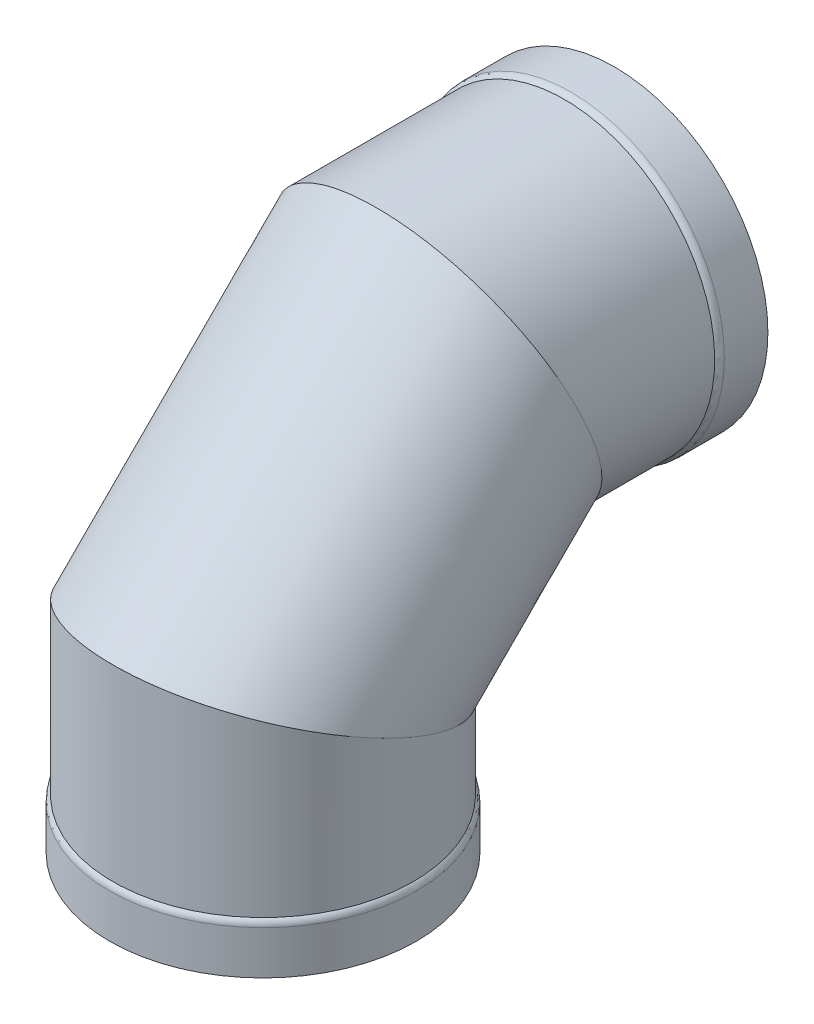
ISO-10303-21;
HEADER;
FILE_DESCRIPTION(('STEP AP214'),'2;1');
FILE_NAME('part.step','',(''),(''),'','','');
FILE_SCHEMA(('AUTOMOTIVE_DESIGN { 1 0 10303 214 1 1 1 1 }'));
ENDSEC;
DATA;
#1=APPLICATION_CONTEXT('core data for automotive mechanical design processes');
#2=APPLICATION_PROTOCOL_DEFINITION('international standard','automotive_design',2000,#1);
#3=PRODUCT_CONTEXT('',#1,'mechanical');
#4=PRODUCT('Part','Part','',(#3));
#5=PRODUCT_RELATED_PRODUCT_CATEGORY('part','',(#4));
#6=PRODUCT_DEFINITION_FORMATION('','',#4);
#7=PRODUCT_DEFINITION_CONTEXT('part definition',#1,'design');
#8=PRODUCT_DEFINITION('design','',#6,#7);
#9=PRODUCT_DEFINITION_SHAPE('','',#8);
#10=(LENGTH_UNIT() NAMED_UNIT(*) SI_UNIT(.MILLI.,.METRE.));
#11=(NAMED_UNIT(*) PLANE_ANGLE_UNIT() SI_UNIT($,.RADIAN.));
#12=(NAMED_UNIT(*) SI_UNIT($,.STERADIAN.) SOLID_ANGLE_UNIT());
#13=UNCERTAINTY_MEASURE_WITH_UNIT(LENGTH_MEASURE(1.E-05),#10,'distance_accuracy_value','');
#14=(GEOMETRIC_REPRESENTATION_CONTEXT(3) GLOBAL_UNCERTAINTY_ASSIGNED_CONTEXT((#13)) GLOBAL_UNIT_ASSIGNED_CONTEXT((#10,
#11,#12)) REPRESENTATION_CONTEXT('',''));
#15=CARTESIAN_POINT('',(0.,0.,0.));
#16=DIRECTION('',(0.,0.,1.));
#17=DIRECTION('',(1.,0.,0.));
#18=AXIS2_PLACEMENT_3D('',#15,#16,#17);
#19=CARTESIAN_POINT('',(0.,534.752662721893,-268.052662721892));
#20=DIRECTION('',(0.,-0.384615384615389,0.923076923076921));
#21=DIRECTION('',(0.,-0.923076923076922,-0.384615384615389));
#22=AXIS2_PLACEMENT_3D('',#19,#20,#21);
#23=PLANE('',#22);
#24=CARTESIAN_POINT('',(0.,534.752662721893,-268.052662721892));
#25=DIRECTION('',(0.,-0.384615384615389,0.923076923076921));
#26=DIRECTION('',(0.,-0.923076923076922,-0.384615384615389));
#27=AXIS2_PLACEMENT_3D('',#24,#25,#26);
#28=ELLIPSE('',#27,242.490625,223.8375);
#29=CARTESIAN_POINT('',(0.,310.915162721894,-361.318287721893));
#30=VERTEX_POINT('',#29);
#31=EDGE_CURVE('E91',#30,#30,#28,.T.);
#32=ORIENTED_EDGE('',*,*,#31,.T.);
#33=EDGE_LOOP('',(#32));
#34=FACE_BOUND('',#33,.T.);
#35=CARTESIAN_POINT('',(0.,534.752662721893,-268.052662721892));
#36=DIRECTION('',(0.,-0.384615384615389,0.923076923076921));
#37=DIRECTION('',(0.,-0.923076923076922,-0.384615384615389));
#38=AXIS2_PLACEMENT_3D('',#35,#36,#37);
#39=ELLIPSE('',#38,247.65,228.6);
#40=CARTESIAN_POINT('',(0.,306.152662721894,-363.302662721893));
#41=VERTEX_POINT('',#40);
#42=EDGE_CURVE('E12',#41,#41,#39,.T.);
#43=ORIENTED_EDGE('',*,*,#42,.F.);
#44=EDGE_LOOP('',(#43));
#45=FACE_BOUND('',#44,.T.);
#46=ADVANCED_FACE('F74',(#34,#45),#23,.F.);
#47=CARTESIAN_POINT('',(0.,266.7,0.));
#48=DIRECTION('',(0.,0.923076923076923,-0.384615384615385));
#49=DIRECTION('',(0.,0.384615384615385,0.923076923076923));
#50=AXIS2_PLACEMENT_3D('',#47,#48,#49);
#51=PLANE('',#50);
#52=CARTESIAN_POINT('',(0.,266.7,0.));
#53=DIRECTION('',(0.,0.923076923076923,-0.384615384615385));
#54=DIRECTION('',(0.,-0.384615384615385,-0.923076923076923));
#55=AXIS2_PLACEMENT_3D('',#52,#53,#54);
#56=ELLIPSE('',#55,242.490625,223.8375);
#57=CARTESIAN_POINT('',(0.,173.434375,-223.8375));
#58=VERTEX_POINT('',#57);
#59=EDGE_CURVE('E105',#58,#58,#56,.T.);
#60=ORIENTED_EDGE('',*,*,#59,.T.);
#61=EDGE_LOOP('',(#60));
#62=FACE_BOUND('',#61,.T.);
#63=CARTESIAN_POINT('',(0.,266.7,0.));
#64=DIRECTION('',(0.,0.923076923076923,-0.384615384615385));
#65=DIRECTION('',(0.,-0.384615384615385,-0.923076923076923));
#66=AXIS2_PLACEMENT_3D('',#63,#64,#65);
#67=ELLIPSE('',#66,247.65,228.6);
#68=CARTESIAN_POINT('',(0.,171.45,-228.6));
#69=VERTEX_POINT('',#68);
#70=EDGE_CURVE('E83',#69,#69,#67,.T.);
#71=ORIENTED_EDGE('',*,*,#70,.F.);
#72=EDGE_LOOP('',(#71));
#73=FACE_BOUND('',#72,.T.);
#74=ADVANCED_FACE('F113',(#62,#73),#51,.F.);
#75=CARTESIAN_POINT('',(0.0286465473319404,361.949999252128,228.599998205108));
#76=CARTESIAN_POINT('',(0.0920664822576588,763.352644182441,-172.802670446663));
#77=CARTESIAN_POINT('',(457.228642957548,361.926127129352,228.542705110444));
#78=CARTESIAN_POINT('',(457.292029403353,763.168511217926,-172.879392515211));
#79=CARTESIAN_POINT('',(457.171349862884,171.426128625095,-228.657291299772));
#80=CARTESIAN_POINT('',(457.107896438838,305.968548296831,-363.37937706567));
#81=CARTESIAN_POINT('',(-0.0286465473320699,171.450000747872,-228.599998205108));
#82=CARTESIAN_POINT('',(-0.0920664822576868,306.152681261346,-363.302654997121));
#83=CARTESIAN_POINT('',(-457.228642957548,171.473872870648,-228.542705110444));
#84=CARTESIAN_POINT('',(-457.292029403353,306.336814225861,-363.225932928573));
#85=CARTESIAN_POINT('',(-457.171349862884,361.973871374905,228.657291299772));
#86=CARTESIAN_POINT('',(-457.107896438838,763.536777146956,-172.725948378115));
#87=CARTESIAN_POINT('',(0.0286465473319404,361.949999252128,228.599998205108));
#88=CARTESIAN_POINT('',(0.0920664822576588,763.352644182441,-172.802670446663));
#89=(BOUNDED_SURFACE() B_SPLINE_SURFACE(3,1,((#75,#76),(#77,#78),(#79,#80),(#81,#82),(#83,#84),
(#85,#86),(#87,#88)),.UNSPECIFIED.,.T.,.F.,.F.) B_SPLINE_SURFACE_WITH_KNOTS((4,3,4),(2,2),(0.,
0.5,1.),(0.,1.),.UNSPECIFIED.) GEOMETRIC_REPRESENTATION_ITEM() RATIONAL_B_SPLINE_SURFACE(((1.,
1.),(0.333333333333333,0.333333333333333),(0.333333333333333,0.333333333333333),(1.,1.),
(0.333333333333333,0.333333333333333),(0.333333333333333,0.333333333333333),(1.,1.))) REPRESENTATION_ITEM('') SURFACE());
#90=ORIENTED_EDGE('',*,*,#70,.T.);
#91=EDGE_LOOP('',(#90));
#92=FACE_BOUND('',#91,.T.);
#93=ORIENTED_EDGE('',*,*,#42,.T.);
#94=EDGE_LOOP('',(#93));
#95=FACE_BOUND('',#94,.T.);
#96=ADVANCED_FACE('F133',(#92,#95),#89,.T.);
#97=CARTESIAN_POINT('',(0.,173.434375,-223.8375));
#98=CARTESIAN_POINT('',(0.,310.915162721894,-361.318287721893));
#99=CARTESIAN_POINT('',(-447.675,173.434375,-223.8375));
#100=CARTESIAN_POINT('',(-447.675,310.915162721894,-361.318287721893));
#101=CARTESIAN_POINT('',(-447.675,359.965625,223.8375));
#102=CARTESIAN_POINT('',(-447.675,758.590162721893,-174.787037721891));
#103=CARTESIAN_POINT('',(0.,359.965625,223.8375));
#104=CARTESIAN_POINT('',(0.,758.590162721893,-174.787037721891));
#105=CARTESIAN_POINT('',(447.675,359.965625,223.8375));
#106=CARTESIAN_POINT('',(447.675,758.590162721893,-174.787037721891));
#107=CARTESIAN_POINT('',(447.675,173.434375,-223.8375));
#108=CARTESIAN_POINT('',(447.675,310.915162721894,-361.318287721893));
#109=CARTESIAN_POINT('',(0.,173.434375,-223.8375));
#110=CARTESIAN_POINT('',(0.,310.915162721894,-361.318287721893));
#111=(BOUNDED_SURFACE() B_SPLINE_SURFACE(3,1,((#97,#98),(#99,#100),(#101,#102),(#103,#104),
(#105,#106),(#107,#108),(#109,#110)),.UNSPECIFIED.,.T.,.F.,.F.) B_SPLINE_SURFACE_WITH_KNOTS((4,
3,4),(2,2),(0.,0.5,1.),(0.,1.),
.UNSPECIFIED.) GEOMETRIC_REPRESENTATION_ITEM() RATIONAL_B_SPLINE_SURFACE(((1.,1.),
(0.333333333333333,0.333333333333333),(0.333333333333333,0.333333333333333),(1.,1.),
(0.333333333333333,0.333333333333333),(0.333333333333333,0.333333333333333),(1.,1.))) REPRESENTATION_ITEM('') SURFACE());
#112=ORIENTED_EDGE('',*,*,#59,.F.);
#113=EDGE_LOOP('',(#112));
#114=FACE_BOUND('',#113,.T.);
#115=ORIENTED_EDGE('',*,*,#31,.F.);
#116=EDGE_LOOP('',(#115));
#117=FACE_BOUND('',#116,.T.);
#118=ADVANCED_FACE('F134',(#114,#117),#111,.F.);
#119=CLOSED_SHELL('',(#46,#74,#96,#118));
#120=MANIFOLD_SOLID_BREP('B2',#119);
#121=CARTESIAN_POINT('',(0.,534.752662721895,-586.86645582534));
#122=DIRECTION('',(0.,0.,-1.));
#123=DIRECTION('',(0.,-1.,0.));
#124=AXIS2_PLACEMENT_3D('',#121,#122,#123);
#125=CYLINDRICAL_SURFACE('',#124,228.6);
#126=CARTESIAN_POINT('',(0.,534.752662721894,-458.552662721892));
#127=DIRECTION('',(0.,0.,1.));
#128=DIRECTION('',(0.,-1.,0.));
#129=AXIS2_PLACEMENT_3D('',#126,#127,#128);
#130=CIRCLE('',#129,228.6);
#131=CARTESIAN_POINT('',(0.,306.152662721894,-458.552662721893));
#132=VERTEX_POINT('',#131);
#133=EDGE_CURVE('E275',#132,#132,#130,.T.);
#134=ORIENTED_EDGE('',*,*,#133,.T.);
#135=EDGE_LOOP('',(#134));
#136=FACE_BOUND('',#135,.T.);
#137=CARTESIAN_POINT('',(0.,534.752662721893,-268.052662721892));
#138=DIRECTION('',(0.,-0.384615384615389,0.923076923076921));
#139=DIRECTION('',(0.,-0.923076923076921,-0.384615384615389));
#140=AXIS2_PLACEMENT_3D('',#137,#138,#139);
#141=ELLIPSE('',#140,247.65,228.6);
#142=CARTESIAN_POINT('',(0.,306.152662721894,-363.302662721893));
#143=VERTEX_POINT('',#142);
#144=EDGE_CURVE('E287',#143,#143,#141,.T.);
#145=ORIENTED_EDGE('',*,*,#144,.F.);
#146=EDGE_LOOP('',(#145));
#147=FACE_BOUND('',#146,.T.);
#148=ADVANCED_FACE('F261',(#136,#147),#125,.T.);
#149=CARTESIAN_POINT('',(0.,534.752662721895,-586.86645582534));
#150=DIRECTION('',(0.,0.,-1.));
#151=DIRECTION('',(0.,-1.,0.));
#152=AXIS2_PLACEMENT_3D('',#149,#150,#151);
#153=CYLINDRICAL_SURFACE('',#152,233.3625);
#154=CARTESIAN_POINT('',(0.,534.752662721894,-468.46659704435));
#155=DIRECTION('',(0.,0.,1.));
#156=DIRECTION('',(0.,-1.,0.));
#157=AXIS2_PLACEMENT_3D('',#154,#155,#156);
#158=CIRCLE('',#157,233.3625);
#159=CARTESIAN_POINT('',(0.,301.390162721894,-468.466597044351));
#160=VERTEX_POINT('',#159);
#161=EDGE_CURVE('E269',#160,#160,#158,.F.);
#162=ORIENTED_EDGE('',*,*,#161,.T.);
#163=EDGE_LOOP('',(#162));
#164=FACE_BOUND('',#163,.T.);
#165=CARTESIAN_POINT('',(0.,534.752662721894,-534.752662721892));
#166=DIRECTION('',(0.,0.,1.));
#167=DIRECTION('',(0.,-1.,0.));
#168=AXIS2_PLACEMENT_3D('',#165,#166,#167);
#169=CIRCLE('',#168,233.3625);
#170=CARTESIAN_POINT('',(0.,301.390162721894,-534.752662721893));
#171=VERTEX_POINT('',#170);
#172=EDGE_CURVE('E281',#171,#171,#169,.T.);
#173=ORIENTED_EDGE('',*,*,#172,.T.);
#174=EDGE_LOOP('',(#173));
#175=FACE_BOUND('',#174,.T.);
#176=ADVANCED_FACE('F308',(#164,#175),#153,.T.);
#177=CARTESIAN_POINT('',(0.,768.115162721895,-534.752662721891));
#178=DIRECTION('',(0.,0.,1.));
#179=DIRECTION('',(0.,1.,0.));
#180=AXIS2_PLACEMENT_3D('',#177,#178,#179);
#181=PLANE('',#180);
#182=CARTESIAN_POINT('',(0.,534.752662721894,-534.752662721892));
#183=DIRECTION('',(0.,0.,1.));
#184=DIRECTION('',(0.,-1.,0.));
#185=AXIS2_PLACEMENT_3D('',#182,#183,#184);
#186=CIRCLE('',#185,228.6);
#187=CARTESIAN_POINT('',(0.,306.152662721894,-534.752662721893));
#188=VERTEX_POINT('',#187);
#189=EDGE_CURVE('E292',#188,#188,#186,.T.);
#190=ORIENTED_EDGE('',*,*,#189,.T.);
#191=EDGE_LOOP('',(#190));
#192=FACE_BOUND('',#191,.T.);
#193=ORIENTED_EDGE('',*,*,#172,.F.);
#194=EDGE_LOOP('',(#193));
#195=FACE_BOUND('',#194,.T.);
#196=ADVANCED_FACE('F314',(#192,#195),#181,.F.);
#197=CARTESIAN_POINT('',(0.,534.752662721895,-586.86645582534));
#198=DIRECTION('',(0.,0.,-1.));
#199=DIRECTION('',(0.,-1.,0.));
#200=AXIS2_PLACEMENT_3D('',#197,#198,#199);
#201=CYLINDRICAL_SURFACE('',#200,228.6);
#202=CARTESIAN_POINT('',(0.,534.752662721894,-473.22909704435));
#203=DIRECTION('',(0.,0.,1.));
#204=DIRECTION('',(0.,-1.,0.));
#205=AXIS2_PLACEMENT_3D('',#202,#203,#204);
#206=CIRCLE('',#205,228.6);
#207=CARTESIAN_POINT('',(0.,306.152662721894,-473.229097044351));
#208=VERTEX_POINT('',#207);
#209=EDGE_CURVE('E73',#208,#208,#206,.T.);
#210=ORIENTED_EDGE('',*,*,#209,.T.);
#211=EDGE_LOOP('',(#210));
#212=FACE_BOUND('',#211,.T.);
#213=ORIENTED_EDGE('',*,*,#189,.F.);
#214=EDGE_LOOP('',(#213));
#215=FACE_BOUND('',#214,.T.);
#216=ADVANCED_FACE('F333',(#212,#215),#201,.F.);
#217=CARTESIAN_POINT('',(0.,534.752662721895,-586.86645582534));
#218=DIRECTION('',(0.,0.,-1.));
#219=DIRECTION('',(0.,-1.,0.));
#220=AXIS2_PLACEMENT_3D('',#217,#218,#219);
#221=CYLINDRICAL_SURFACE('',#220,223.8375);
#222=CARTESIAN_POINT('',(0.,534.752662721893,-268.052662721892));
#223=DIRECTION('',(0.,-0.384615384615389,0.923076923076921));
#224=DIRECTION('',(0.,-0.923076923076921,-0.384615384615389));
#225=AXIS2_PLACEMENT_3D('',#222,#223,#224);
#226=ELLIPSE('',#225,242.490625,223.8375);
#227=CARTESIAN_POINT('',(0.,310.915162721894,-361.318287721893));
#228=VERTEX_POINT('',#227);
#229=EDGE_CURVE('E284',#228,#228,#226,.F.);
#230=ORIENTED_EDGE('',*,*,#229,.F.);
#231=EDGE_LOOP('',(#230));
#232=FACE_BOUND('',#231,.T.);
#233=CARTESIAN_POINT('',(0.,534.752662721894,-463.315162721892));
#234=DIRECTION('',(0.,0.,1.));
#235=DIRECTION('',(0.,-1.,0.));
#236=AXIS2_PLACEMENT_3D('',#233,#234,#235);
#237=CIRCLE('',#236,223.8375);
#238=CARTESIAN_POINT('',(0.,310.915162721894,-463.315162721893));
#239=VERTEX_POINT('',#238);
#240=EDGE_CURVE('E296',#239,#239,#237,.T.);
#241=ORIENTED_EDGE('',*,*,#240,.F.);
#242=EDGE_LOOP('',(#241));
#243=FACE_BOUND('',#242,.T.);
#244=ADVANCED_FACE('F325',(#232,#243),#221,.F.);
#245=CARTESIAN_POINT('',(-233.3625,763.352662721893,-172.802662721891));
#246=DIRECTION('',(0.,0.384615384615389,-0.923076923076921));
#247=DIRECTION('',(0.,-0.923076923076922,-0.384615384615389));
#248=AXIS2_PLACEMENT_3D('',#245,#246,#247);
#249=PLANE('',#248);
#250=ORIENTED_EDGE('',*,*,#229,.T.);
#251=EDGE_LOOP('',(#250));
#252=FACE_BOUND('',#251,.T.);
#253=ORIENTED_EDGE('',*,*,#144,.T.);
#254=EDGE_LOOP('',(#253));
#255=FACE_BOUND('',#254,.T.);
#256=ADVANCED_FACE('F305',(#252,#255),#249,.F.);
#257=CARTESIAN_POINT('',(0.,534.752662721894,-468.46659704435));
#258=DIRECTION('',(0.,0.,1.));
#259=DIRECTION('',(0.,-1.,0.));
#260=AXIS2_PLACEMENT_3D('',#257,#258,#259);
#261=TOROIDAL_SURFACE('',#260,220.6625,12.7);
#262=ORIENTED_EDGE('',*,*,#161,.F.);
#263=EDGE_LOOP('',(#262));
#264=FACE_BOUND('',#263,.T.);
#265=ORIENTED_EDGE('',*,*,#133,.F.);
#266=EDGE_LOOP('',(#265));
#267=FACE_BOUND('',#266,.T.);
#268=ADVANCED_FACE('F317',(#264,#267),#261,.T.);
#269=CARTESIAN_POINT('',(0.,534.752662721894,-473.22909704435));
#270=DIRECTION('',(0.,0.,1.));
#271=DIRECTION('',(0.,-1.,0.));
#272=AXIS2_PLACEMENT_3D('',#269,#270,#271);
#273=TOROIDAL_SURFACE('',#272,215.9,12.7);
#274=ORIENTED_EDGE('',*,*,#240,.T.);
#275=EDGE_LOOP('',(#274));
#276=FACE_BOUND('',#275,.T.);
#277=ORIENTED_EDGE('',*,*,#209,.F.);
#278=EDGE_LOOP('',(#277));
#279=FACE_BOUND('',#278,.T.);
#280=ADVANCED_FACE('F263',(#276,#279),#273,.F.);
#281=CLOSED_SHELL('',(#148,#176,#196,#216,#244,#256,#268,#280));
#282=MANIFOLD_SOLID_BREP('B7',#281);
#283=CARTESIAN_POINT('',(0.,-52.1137931034483,0.));
#284=DIRECTION('',(0.,-1.,0.));
#285=DIRECTION('',(0.,0.,-1.));
#286=AXIS2_PLACEMENT_3D('',#283,#284,#285);
#287=CYLINDRICAL_SURFACE('',#286,228.6);
#288=CARTESIAN_POINT('',(0.,76.2,0.));
#289=DIRECTION('',(0.,-1.,0.));
#290=DIRECTION('',(0.,0.,-1.));
#291=AXIS2_PLACEMENT_3D('',#288,#289,#290);
#292=CIRCLE('',#291,228.6);
#293=CARTESIAN_POINT('',(0.,76.2,-228.6));
#294=VERTEX_POINT('',#293);
#295=EDGE_CURVE('E429',#294,#294,#292,.T.);
#296=ORIENTED_EDGE('',*,*,#295,.F.);
#297=EDGE_LOOP('',(#296));
#298=FACE_BOUND('',#297,.T.);
#299=CARTESIAN_POINT('',(0.,266.7,0.));
#300=DIRECTION('',(0.,-0.923076923076923,0.384615384615385));
#301=DIRECTION('',(0.,-0.384615384615385,-0.923076923076923));
#302=AXIS2_PLACEMENT_3D('',#299,#300,#301);
#303=ELLIPSE('',#302,247.65,228.6);
#304=CARTESIAN_POINT('',(0.,171.45,-228.6));
#305=VERTEX_POINT('',#304);
#306=EDGE_CURVE('E441',#305,#305,#303,.T.);
#307=ORIENTED_EDGE('',*,*,#306,.T.);
#308=EDGE_LOOP('',(#307));
#309=FACE_BOUND('',#308,.T.);
#310=ADVANCED_FACE('F415',(#298,#309),#287,.T.);
#311=CARTESIAN_POINT('',(0.,-52.1137931034483,0.));
#312=DIRECTION('',(0.,-1.,0.));
#313=DIRECTION('',(0.,0.,-1.));
#314=AXIS2_PLACEMENT_3D('',#311,#312,#313);
#315=CYLINDRICAL_SURFACE('',#314,233.3625);
#316=CARTESIAN_POINT('',(0.,66.2860656775425,0.));
#317=DIRECTION('',(0.,1.,0.));
#318=DIRECTION('',(0.,0.,1.));
#319=AXIS2_PLACEMENT_3D('',#316,#317,#318);
#320=CIRCLE('',#319,233.3625);
#321=CARTESIAN_POINT('',(0.,66.2860656775425,233.3625));
#322=VERTEX_POINT('',#321);
#323=EDGE_CURVE('E260',#322,#322,#320,.F.);
#324=ORIENTED_EDGE('',*,*,#323,.T.);
#325=EDGE_LOOP('',(#324));
#326=FACE_BOUND('',#325,.T.);
#327=CARTESIAN_POINT('',(0.,0.,0.));
#328=DIRECTION('',(0.,-1.,0.));
#329=DIRECTION('',(0.,0.,-1.));
#330=AXIS2_PLACEMENT_3D('',#327,#328,#329);
#331=CIRCLE('',#330,233.3625);
#332=CARTESIAN_POINT('',(0.,0.,-233.3625));
#333=VERTEX_POINT('',#332);
#334=EDGE_CURVE('E435',#333,#333,#331,.T.);
#335=ORIENTED_EDGE('',*,*,#334,.F.);
#336=EDGE_LOOP('',(#335));
#337=FACE_BOUND('',#336,.T.);
#338=ADVANCED_FACE('F476',(#326,#337),#315,.T.);
#339=CARTESIAN_POINT('',(0.,0.,233.3625));
#340=DIRECTION('',(0.,1.,0.));
#341=DIRECTION('',(0.,0.,1.));
#342=AXIS2_PLACEMENT_3D('',#339,#340,#341);
#343=PLANE('',#342);
#344=CARTESIAN_POINT('',(0.,0.,0.));
#345=DIRECTION('',(0.,-1.,0.));
#346=DIRECTION('',(0.,0.,-1.));
#347=AXIS2_PLACEMENT_3D('',#344,#345,#346);
#348=CIRCLE('',#347,228.6);
#349=CARTESIAN_POINT('',(0.,0.,-228.6));
#350=VERTEX_POINT('',#349);
#351=EDGE_CURVE('E446',#350,#350,#348,.T.);
#352=ORIENTED_EDGE('',*,*,#351,.F.);
#353=EDGE_LOOP('',(#352));
#354=FACE_BOUND('',#353,.T.);
#355=ORIENTED_EDGE('',*,*,#334,.T.);
#356=EDGE_LOOP('',(#355));
#357=FACE_BOUND('',#356,.T.);
#358=ADVANCED_FACE('F482',(#354,#357),#343,.F.);
#359=CARTESIAN_POINT('',(0.,-52.1137931034483,0.));
#360=DIRECTION('',(0.,-1.,0.));
#361=DIRECTION('',(0.,0.,-1.));
#362=AXIS2_PLACEMENT_3D('',#359,#360,#361);
#363=CYLINDRICAL_SURFACE('',#362,228.6);
#364=CARTESIAN_POINT('',(0.,61.5235656775425,0.));
#365=DIRECTION('',(0.,1.,0.));
#366=DIRECTION('',(0.,0.,1.));
#367=AXIS2_PLACEMENT_3D('',#364,#365,#366);
#368=CIRCLE('',#367,228.6);
#369=CARTESIAN_POINT('',(0.,61.5235656775425,228.6));
#370=VERTEX_POINT('',#369);
#371=EDGE_CURVE('E423',#370,#370,#368,.T.);
#372=ORIENTED_EDGE('',*,*,#371,.T.);
#373=EDGE_LOOP('',(#372));
#374=FACE_BOUND('',#373,.T.);
#375=ORIENTED_EDGE('',*,*,#351,.T.);
#376=EDGE_LOOP('',(#375));
#377=FACE_BOUND('',#376,.T.);
#378=ADVANCED_FACE('F471',(#374,#377),#363,.F.);
#379=CARTESIAN_POINT('',(0.,-52.1137931034483,0.));
#380=DIRECTION('',(0.,-1.,0.));
#381=DIRECTION('',(0.,0.,-1.));
#382=AXIS2_PLACEMENT_3D('',#379,#380,#381);
#383=CYLINDRICAL_SURFACE('',#382,223.8375);
#384=CARTESIAN_POINT('',(0.,266.7,0.));
#385=DIRECTION('',(0.,-0.923076923076923,0.384615384615385));
#386=DIRECTION('',(0.,-0.384615384615385,-0.923076923076923));
#387=AXIS2_PLACEMENT_3D('',#384,#385,#386);
#388=ELLIPSE('',#387,242.490625,223.8375);
#389=CARTESIAN_POINT('',(0.,173.434375,-223.8375));
#390=VERTEX_POINT('',#389);
#391=EDGE_CURVE('E438',#390,#390,#388,.F.);
#392=ORIENTED_EDGE('',*,*,#391,.T.);
#393=EDGE_LOOP('',(#392));
#394=FACE_BOUND('',#393,.T.);
#395=CARTESIAN_POINT('',(0.,71.4375,0.));
#396=DIRECTION('',(0.,-1.,0.));
#397=DIRECTION('',(0.,0.,-1.));
#398=AXIS2_PLACEMENT_3D('',#395,#396,#397);
#399=CIRCLE('',#398,223.8375);
#400=CARTESIAN_POINT('',(0.,71.4375,-223.8375));
#401=VERTEX_POINT('',#400);
#402=EDGE_CURVE('E450',#401,#401,#399,.T.);
#403=ORIENTED_EDGE('',*,*,#402,.T.);
#404=EDGE_LOOP('',(#403));
#405=FACE_BOUND('',#404,.T.);
#406=ADVANCED_FACE('F463',(#394,#405),#383,.F.);
#407=CARTESIAN_POINT('',(-233.3625,361.95,228.6));
#408=DIRECTION('',(0.,-0.923076923076923,0.384615384615385));
#409=DIRECTION('',(0.,-0.384615384615385,-0.923076923076923));
#410=AXIS2_PLACEMENT_3D('',#407,#408,#409);
#411=PLANE('',#410);
#412=ORIENTED_EDGE('',*,*,#391,.F.);
#413=EDGE_LOOP('',(#412));
#414=FACE_BOUND('',#413,.T.);
#415=ORIENTED_EDGE('',*,*,#306,.F.);
#416=EDGE_LOOP('',(#415));
#417=FACE_BOUND('',#416,.T.);
#418=ADVANCED_FACE('F460',(#414,#417),#411,.F.);
#419=CARTESIAN_POINT('',(0.,61.5235656775425,0.));
#420=DIRECTION('',(0.,1.,0.));
#421=DIRECTION('',(0.,0.,1.));
#422=AXIS2_PLACEMENT_3D('',#419,#420,#421);
#423=TOROIDAL_SURFACE('',#422,215.9,12.7);
#424=ORIENTED_EDGE('',*,*,#371,.F.);
#425=EDGE_LOOP('',(#424));
#426=FACE_BOUND('',#425,.T.);
#427=ORIENTED_EDGE('',*,*,#402,.F.);
#428=EDGE_LOOP('',(#427));
#429=FACE_BOUND('',#428,.T.);
#430=ADVANCED_FACE('F462',(#426,#429),#423,.F.);
#431=CARTESIAN_POINT('',(0.,66.2860656775425,0.));
#432=DIRECTION('',(0.,1.,0.));
#433=DIRECTION('',(0.,0.,1.));
#434=AXIS2_PLACEMENT_3D('',#431,#432,#433);
#435=TOROIDAL_SURFACE('',#434,220.6625,12.7);
#436=ORIENTED_EDGE('',*,*,#295,.T.);
#437=EDGE_LOOP('',(#436));
#438=FACE_BOUND('',#437,.T.);
#439=ORIENTED_EDGE('',*,*,#323,.F.);
#440=EDGE_LOOP('',(#439));
#441=FACE_BOUND('',#440,.T.);
#442=ADVANCED_FACE('F417',(#438,#441),#435,.T.);
#443=CLOSED_SHELL('',(#310,#338,#358,#378,#406,#418,#430,#442));
#444=MANIFOLD_SOLID_BREP('B68',#443);
#445=ADVANCED_BREP_SHAPE_REPRESENTATION('',(#18,#120,#282,#444),#14);
#446=SHAPE_DEFINITION_REPRESENTATION(#9,#445);
ENDSEC;
END-ISO-10303-21;
